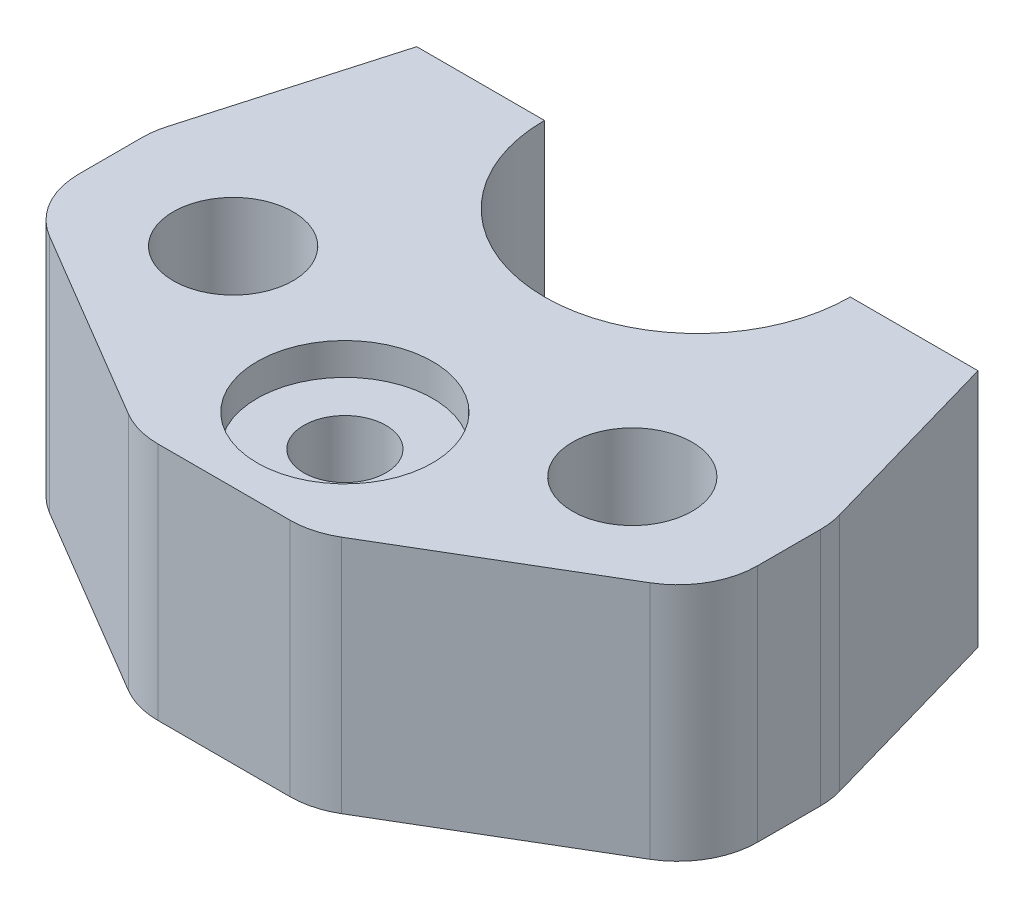
ISO-10303-21;
HEADER;
FILE_DESCRIPTION(('STEP AP214'),'2;1');
FILE_NAME('part.step','',(''),(''),'','','');
FILE_SCHEMA(('AUTOMOTIVE_DESIGN { 1 0 10303 214 1 1 1 1 }'));
ENDSEC;
DATA;
#1=APPLICATION_CONTEXT('core data for automotive mechanical design processes');
#2=APPLICATION_PROTOCOL_DEFINITION('international standard','automotive_design',2000,#1);
#3=PRODUCT_CONTEXT('',#1,'mechanical');
#4=PRODUCT('Part','Part','',(#3));
#5=PRODUCT_RELATED_PRODUCT_CATEGORY('part','',(#4));
#6=PRODUCT_DEFINITION_FORMATION('','',#4);
#7=PRODUCT_DEFINITION_CONTEXT('part definition',#1,'design');
#8=PRODUCT_DEFINITION('design','',#6,#7);
#9=PRODUCT_DEFINITION_SHAPE('','',#8);
#10=(LENGTH_UNIT() NAMED_UNIT(*) SI_UNIT(.MILLI.,.METRE.));
#11=(NAMED_UNIT(*) PLANE_ANGLE_UNIT() SI_UNIT($,.RADIAN.));
#12=(NAMED_UNIT(*) SI_UNIT($,.STERADIAN.) SOLID_ANGLE_UNIT());
#13=UNCERTAINTY_MEASURE_WITH_UNIT(LENGTH_MEASURE(1.E-05),#10,'distance_accuracy_value','');
#14=(GEOMETRIC_REPRESENTATION_CONTEXT(3) GLOBAL_UNCERTAINTY_ASSIGNED_CONTEXT((#13)) GLOBAL_UNIT_ASSIGNED_CONTEXT((#10,
#11,#12)) REPRESENTATION_CONTEXT('',''));
#15=CARTESIAN_POINT('',(0.,0.,0.));
#16=DIRECTION('',(0.,0.,1.));
#17=DIRECTION('',(1.,0.,0.));
#18=AXIS2_PLACEMENT_3D('',#15,#16,#17);
#19=CARTESIAN_POINT('',(0.,30.,44.15));
#20=DIRECTION('',(0.,-1.,0.));
#21=DIRECTION('',(0.,0.,-1.));
#22=AXIS2_PLACEMENT_3D('',#19,#20,#21);
#23=CYLINDRICAL_SURFACE('',#22,5.15);
#24=CARTESIAN_POINT('',(0.,0.,44.15));
#25=DIRECTION('',(0.,1.,0.));
#26=DIRECTION('',(0.,0.,1.));
#27=AXIS2_PLACEMENT_3D('',#24,#25,#26);
#28=CIRCLE('',#27,5.15);
#29=CARTESIAN_POINT('',(0.,0.,49.3));
#30=VERTEX_POINT('',#29);
#31=EDGE_CURVE('E206',#30,#30,#28,.T.);
#32=ORIENTED_EDGE('',*,*,#31,.F.);
#33=EDGE_LOOP('',(#32));
#34=FACE_BOUND('',#33,.T.);
#35=CARTESIAN_POINT('',(0.,26.,44.15));
#36=DIRECTION('',(0.,1.,0.));
#37=DIRECTION('',(0.,0.,1.));
#38=AXIS2_PLACEMENT_3D('',#35,#36,#37);
#39=CIRCLE('',#38,5.15);
#40=CARTESIAN_POINT('',(0.,26.,49.3));
#41=VERTEX_POINT('',#40);
#42=EDGE_CURVE('E43',#41,#41,#39,.T.);
#43=ORIENTED_EDGE('',*,*,#42,.T.);
#44=EDGE_LOOP('',(#43));
#45=FACE_BOUND('',#44,.T.);
#46=ADVANCED_FACE('F39',(#34,#45),#23,.F.);
#47=CARTESIAN_POINT('',(0.,30.,0.));
#48=DIRECTION('',(0.,0.,1.));
#49=DIRECTION('',(1.,0.,0.));
#50=AXIS2_PLACEMENT_3D('',#47,#48,#49);
#51=PLANE('',#50);
#52=DIRECTION('',(-1.,0.,0.));
#53=VECTOR('',#52,1.);
#54=CARTESIAN_POINT('',(0.,0.,0.));
#55=LINE('',#54,#53);
#56=CARTESIAN_POINT('',(35.15,0.,0.));
#57=VERTEX_POINT('',#56);
#58=CARTESIAN_POINT('',(19.15,0.,0.));
#59=VERTEX_POINT('',#58);
#60=EDGE_CURVE('E168',#57,#59,#55,.T.);
#61=ORIENTED_EDGE('',*,*,#60,.T.);
#62=DIRECTION('',(0.,-1.,0.));
#63=VECTOR('',#62,1.);
#64=CARTESIAN_POINT('',(19.15,30.,0.));
#65=LINE('',#64,#63);
#66=CARTESIAN_POINT('',(19.15,30.,0.));
#67=VERTEX_POINT('',#66);
#68=EDGE_CURVE('E165',#67,#59,#65,.T.);
#69=ORIENTED_EDGE('',*,*,#68,.F.);
#70=DIRECTION('',(-1.,0.,0.));
#71=VECTOR('',#70,1.);
#72=CARTESIAN_POINT('',(0.,30.,0.));
#73=LINE('',#72,#71);
#74=CARTESIAN_POINT('',(35.15,30.,0.));
#75=VERTEX_POINT('',#74);
#76=EDGE_CURVE('E153',#75,#67,#73,.T.);
#77=ORIENTED_EDGE('',*,*,#76,.F.);
#78=DIRECTION('',(0.,-1.,0.));
#79=VECTOR('',#78,1.);
#80=CARTESIAN_POINT('',(35.15,30.,0.));
#81=LINE('',#80,#79);
#82=EDGE_CURVE('E205',#75,#57,#81,.T.);
#83=ORIENTED_EDGE('',*,*,#82,.T.);
#84=EDGE_LOOP('',(#61,#69,#77,#83));
#85=FACE_BOUND('',#84,.T.);
#86=ADVANCED_FACE('F166',(#85),#51,.F.);
#87=CARTESIAN_POINT('',(0.,30.,0.));
#88=DIRECTION('',(0.,-1.,0.));
#89=DIRECTION('',(0.,0.,-1.));
#90=AXIS2_PLACEMENT_3D('',#87,#88,#89);
#91=CYLINDRICAL_SURFACE('',#90,19.15);
#92=CARTESIAN_POINT('',(0.,0.,0.));
#93=DIRECTION('',(0.,1.,0.));
#94=DIRECTION('',(0.,0.,1.));
#95=AXIS2_PLACEMENT_3D('',#92,#93,#94);
#96=CIRCLE('',#95,19.15);
#97=CARTESIAN_POINT('',(-19.15,0.,0.));
#98=VERTEX_POINT('',#97);
#99=EDGE_CURVE('E210',#98,#59,#96,.T.);
#100=ORIENTED_EDGE('',*,*,#99,.F.);
#101=DIRECTION('',(0.,-1.,0.));
#102=VECTOR('',#101,1.);
#103=CARTESIAN_POINT('',(-19.15,30.,0.));
#104=LINE('',#103,#102);
#105=CARTESIAN_POINT('',(-19.15,30.,0.));
#106=VERTEX_POINT('',#105);
#107=EDGE_CURVE('E173',#106,#98,#104,.T.);
#108=ORIENTED_EDGE('',*,*,#107,.F.);
#109=CARTESIAN_POINT('',(0.,30.,0.));
#110=DIRECTION('',(0.,1.,0.));
#111=DIRECTION('',(0.,0.,1.));
#112=AXIS2_PLACEMENT_3D('',#109,#110,#111);
#113=CIRCLE('',#112,19.15);
#114=EDGE_CURVE('E159',#106,#67,#113,.T.);
#115=ORIENTED_EDGE('',*,*,#114,.T.);
#116=ORIENTED_EDGE('',*,*,#68,.T.);
#117=EDGE_LOOP('',(#100,#108,#115,#116));
#118=FACE_BOUND('',#117,.T.);
#119=ADVANCED_FACE('F175',(#118),#91,.F.);
#120=CARTESIAN_POINT('',(0.,30.,0.));
#121=DIRECTION('',(0.,0.,1.));
#122=DIRECTION('',(1.,0.,0.));
#123=AXIS2_PLACEMENT_3D('',#120,#121,#122);
#124=PLANE('',#123);
#125=DIRECTION('',(-1.,0.,0.));
#126=VECTOR('',#125,1.);
#127=CARTESIAN_POINT('',(0.,0.,0.));
#128=LINE('',#127,#126);
#129=CARTESIAN_POINT('',(-35.15,0.,0.));
#130=VERTEX_POINT('',#129);
#131=EDGE_CURVE('E212',#98,#130,#128,.T.);
#132=ORIENTED_EDGE('',*,*,#131,.T.);
#133=DIRECTION('',(0.,-1.,0.));
#134=VECTOR('',#133,1.);
#135=CARTESIAN_POINT('',(-35.15,30.,0.));
#136=LINE('',#135,#134);
#137=CARTESIAN_POINT('',(-35.15,30.,0.));
#138=VERTEX_POINT('',#137);
#139=EDGE_CURVE('E241',#138,#130,#136,.T.);
#140=ORIENTED_EDGE('',*,*,#139,.F.);
#141=DIRECTION('',(-1.,0.,0.));
#142=VECTOR('',#141,1.);
#143=CARTESIAN_POINT('',(0.,30.,0.));
#144=LINE('',#143,#142);
#145=EDGE_CURVE('E177',#106,#138,#144,.T.);
#146=ORIENTED_EDGE('',*,*,#145,.F.);
#147=ORIENTED_EDGE('',*,*,#107,.T.);
#148=EDGE_LOOP('',(#132,#140,#146,#147));
#149=FACE_BOUND('',#148,.T.);
#150=ADVANCED_FACE('F330',(#149),#124,.F.);
#151=CARTESIAN_POINT('',(-32.4828124012388,30.,-9.30794039567665));
#152=DIRECTION('',(0.961311521161602,0.,0.275463535303618));
#153=DIRECTION('',(0.275463535303618,0.,-0.961311521161602));
#154=AXIS2_PLACEMENT_3D('',#151,#152,#153);
#155=PLANE('',#154);
#156=DIRECTION('',(-0.275463535303618,0.,0.961311521161602));
#157=VECTOR('',#156,1.);
#158=CARTESIAN_POINT('',(-32.4828124012388,0.,-9.30794039567665));
#159=LINE('',#158,#157);
#160=CARTESIAN_POINT('',(-42.113115211616,0.,24.2998510446192));
#161=VERTEX_POINT('',#160);
#162=EDGE_CURVE('E214',#130,#161,#159,.T.);
#163=ORIENTED_EDGE('',*,*,#162,.T.);
#164=DIRECTION('',(0.,-1.,0.));
#165=VECTOR('',#164,1.);
#166=CARTESIAN_POINT('',(-42.113115211616,30.,24.2998510446192));
#167=LINE('',#166,#165);
#168=CARTESIAN_POINT('',(-42.113115211616,30.,24.2998510446192));
#169=VERTEX_POINT('',#168);
#170=EDGE_CURVE('E261',#161,#169,#167,.F.);
#171=ORIENTED_EDGE('',*,*,#170,.T.);
#172=DIRECTION('',(-0.275463535303618,0.,0.961311521161602));
#173=VECTOR('',#172,1.);
#174=CARTESIAN_POINT('',(-32.4828124012388,30.,-9.30794039567665));
#175=LINE('',#174,#173);
#176=EDGE_CURVE('E179',#138,#169,#175,.T.);
#177=ORIENTED_EDGE('',*,*,#176,.F.);
#178=ORIENTED_EDGE('',*,*,#139,.T.);
#179=EDGE_LOOP('',(#163,#171,#177,#178));
#180=FACE_BOUND('',#179,.T.);
#181=ADVANCED_FACE('F333',(#180),#155,.F.);
#182=CARTESIAN_POINT('',(-42.5,30.,0.));
#183=DIRECTION('',(1.,0.,0.));
#184=DIRECTION('',(0.,0.,-1.));
#185=AXIS2_PLACEMENT_3D('',#182,#183,#184);
#186=PLANE('',#185);
#187=DIRECTION('',(0.,0.,1.));
#188=VECTOR('',#187,1.);
#189=CARTESIAN_POINT('',(-42.5,30.,0.));
#190=LINE('',#189,#188);
#191=CARTESIAN_POINT('',(-42.5,30.,27.0544863976553));
#192=VERTEX_POINT('',#191);
#193=CARTESIAN_POINT('',(-42.5,30.,34.949364858226));
#194=VERTEX_POINT('',#193);
#195=EDGE_CURVE('E184',#192,#194,#190,.T.);
#196=ORIENTED_EDGE('',*,*,#195,.F.);
#197=DIRECTION('',(0.,-1.,0.));
#198=VECTOR('',#197,1.);
#199=CARTESIAN_POINT('',(-42.5,30.,27.0544863976553));
#200=LINE('',#199,#198);
#201=CARTESIAN_POINT('',(-42.5,0.,27.0544863976553));
#202=VERTEX_POINT('',#201);
#203=EDGE_CURVE('E246',#192,#202,#200,.T.);
#204=ORIENTED_EDGE('',*,*,#203,.T.);
#205=DIRECTION('',(0.,0.,1.));
#206=VECTOR('',#205,1.);
#207=CARTESIAN_POINT('',(-42.5,0.,0.));
#208=LINE('',#207,#206);
#209=CARTESIAN_POINT('',(-42.5,0.,34.949364858226));
#210=VERTEX_POINT('',#209);
#211=EDGE_CURVE('E217',#202,#210,#208,.T.);
#212=ORIENTED_EDGE('',*,*,#211,.T.);
#213=DIRECTION('',(0.,-1.,0.));
#214=VECTOR('',#213,1.);
#215=CARTESIAN_POINT('',(-42.5,30.,34.949364858226));
#216=LINE('',#215,#214);
#217=EDGE_CURVE('E172',#210,#194,#216,.F.);
#218=ORIENTED_EDGE('',*,*,#217,.T.);
#219=EDGE_LOOP('',(#196,#204,#212,#218));
#220=FACE_BOUND('',#219,.T.);
#221=ADVANCED_FACE('F341',(#220),#186,.F.);
#222=CARTESIAN_POINT('',(-28.8516591453074,30.,48.7306843473021));
#223=DIRECTION('',(0.50946539309729,0.,-0.86049114651821));
#224=DIRECTION('',(-0.86049114651821,0.,-0.50946539309729));
#225=AXIS2_PLACEMENT_3D('',#222,#223,#224);
#226=PLANE('',#225);
#227=DIRECTION('',(0.86049114651821,0.,0.50946539309729));
#228=VECTOR('',#227,1.);
#229=CARTESIAN_POINT('',(-28.8516591453074,30.,48.7306843473021));
#230=LINE('',#229,#228);
#231=CARTESIAN_POINT('',(-37.5946539309729,30.,43.5542763234081));
#232=VERTEX_POINT('',#231);
#233=CARTESIAN_POINT('',(-13.3563157558586,30.,57.9049114651821));
#234=VERTEX_POINT('',#233);
#235=EDGE_CURVE('E187',#232,#234,#230,.T.);
#236=ORIENTED_EDGE('',*,*,#235,.F.);
#237=DIRECTION('',(0.,-1.,0.));
#238=VECTOR('',#237,1.);
#239=CARTESIAN_POINT('',(-37.5946539309729,30.,43.5542763234081));
#240=LINE('',#239,#238);
#241=CARTESIAN_POINT('',(-37.5946539309729,0.,43.5542763234081));
#242=VERTEX_POINT('',#241);
#243=EDGE_CURVE('E275',#232,#242,#240,.T.);
#244=ORIENTED_EDGE('',*,*,#243,.T.);
#245=DIRECTION('',(0.86049114651821,0.,0.50946539309729));
#246=VECTOR('',#245,1.);
#247=CARTESIAN_POINT('',(-28.8516591453074,0.,48.7306843473021));
#248=LINE('',#247,#246);
#249=CARTESIAN_POINT('',(-13.3563157558586,0.,57.9049114651821));
#250=VERTEX_POINT('',#249);
#251=EDGE_CURVE('E220',#242,#250,#248,.T.);
#252=ORIENTED_EDGE('',*,*,#251,.T.);
#253=DIRECTION('',(0.,-1.,0.));
#254=VECTOR('',#253,1.);
#255=CARTESIAN_POINT('',(-13.3563157558586,30.,57.9049114651821));
#256=LINE('',#255,#254);
#257=EDGE_CURVE('E273',#250,#234,#256,.F.);
#258=ORIENTED_EDGE('',*,*,#257,.T.);
#259=EDGE_LOOP('',(#236,#244,#252,#258));
#260=FACE_BOUND('',#259,.T.);
#261=ADVANCED_FACE('F349',(#260),#226,.F.);
#262=CARTESIAN_POINT('',(0.,30.,59.3));
#263=DIRECTION('',(0.,0.,-1.));
#264=DIRECTION('',(-1.,0.,0.));
#265=AXIS2_PLACEMENT_3D('',#262,#263,#264);
#266=PLANE('',#265);
#267=DIRECTION('',(1.,0.,0.));
#268=VECTOR('',#267,1.);
#269=CARTESIAN_POINT('',(0.,0.,59.3));
#270=LINE('',#269,#268);
#271=CARTESIAN_POINT('',(-8.26166182488574,0.,59.3));
#272=VERTEX_POINT('',#271);
#273=CARTESIAN_POINT('',(8.26166182488575,0.,59.3));
#274=VERTEX_POINT('',#273);
#275=EDGE_CURVE('E223',#272,#274,#270,.T.);
#276=ORIENTED_EDGE('',*,*,#275,.T.);
#277=DIRECTION('',(0.,-1.,0.));
#278=VECTOR('',#277,1.);
#279=CARTESIAN_POINT('',(8.26166182488575,30.,59.3));
#280=LINE('',#279,#278);
#281=CARTESIAN_POINT('',(8.26166182488575,30.,59.3));
#282=VERTEX_POINT('',#281);
#283=EDGE_CURVE('E11',#274,#282,#280,.F.);
#284=ORIENTED_EDGE('',*,*,#283,.T.);
#285=DIRECTION('',(1.,0.,0.));
#286=VECTOR('',#285,1.);
#287=CARTESIAN_POINT('',(0.,30.,59.3));
#288=LINE('',#287,#286);
#289=CARTESIAN_POINT('',(-8.26166182488574,30.,59.3));
#290=VERTEX_POINT('',#289);
#291=EDGE_CURVE('E190',#290,#282,#288,.T.);
#292=ORIENTED_EDGE('',*,*,#291,.F.);
#293=DIRECTION('',(0.,-1.,0.));
#294=VECTOR('',#293,1.);
#295=CARTESIAN_POINT('',(-8.26166182488574,30.,59.3));
#296=LINE('',#295,#294);
#297=EDGE_CURVE('E48',#290,#272,#296,.T.);
#298=ORIENTED_EDGE('',*,*,#297,.T.);
#299=EDGE_LOOP('',(#276,#284,#292,#298));
#300=FACE_BOUND('',#299,.T.);
#301=ADVANCED_FACE('F296',(#300),#266,.F.);
#302=CARTESIAN_POINT('',(28.8516591453075,30.,48.7306843473021));
#303=DIRECTION('',(0.50946539309729,0.,0.86049114651821));
#304=DIRECTION('',(0.86049114651821,0.,-0.50946539309729));
#305=AXIS2_PLACEMENT_3D('',#302,#303,#304);
#306=PLANE('',#305);
#307=DIRECTION('',(-0.86049114651821,0.,0.50946539309729));
#308=VECTOR('',#307,1.);
#309=CARTESIAN_POINT('',(28.8516591453075,0.,48.7306843473021));
#310=LINE('',#309,#308);
#311=CARTESIAN_POINT('',(37.5946539309729,0.,43.5542763234081));
#312=VERTEX_POINT('',#311);
#313=CARTESIAN_POINT('',(13.3563157558586,0.,57.9049114651821));
#314=VERTEX_POINT('',#313);
#315=EDGE_CURVE('E226',#312,#314,#310,.T.);
#316=ORIENTED_EDGE('',*,*,#315,.F.);
#317=DIRECTION('',(0.,-1.,0.));
#318=VECTOR('',#317,1.);
#319=CARTESIAN_POINT('',(37.5946539309729,30.,43.5542763234081));
#320=LINE('',#319,#318);
#321=CARTESIAN_POINT('',(37.5946539309729,30.,43.5542763234081));
#322=VERTEX_POINT('',#321);
#323=EDGE_CURVE('E289',#312,#322,#320,.F.);
#324=ORIENTED_EDGE('',*,*,#323,.T.);
#325=DIRECTION('',(-0.86049114651821,0.,0.50946539309729));
#326=VECTOR('',#325,1.);
#327=CARTESIAN_POINT('',(28.8516591453075,30.,48.7306843473021));
#328=LINE('',#327,#326);
#329=CARTESIAN_POINT('',(13.3563157558586,30.,57.9049114651821));
#330=VERTEX_POINT('',#329);
#331=EDGE_CURVE('E193',#322,#330,#328,.T.);
#332=ORIENTED_EDGE('',*,*,#331,.T.);
#333=DIRECTION('',(0.,-1.,0.));
#334=VECTOR('',#333,1.);
#335=CARTESIAN_POINT('',(13.3563157558587,0.,57.9049114651821));
#336=LINE('',#335,#334);
#337=EDGE_CURVE('E286',#330,#314,#336,.T.);
#338=ORIENTED_EDGE('',*,*,#337,.T.);
#339=EDGE_LOOP('',(#316,#324,#332,#338));
#340=FACE_BOUND('',#339,.T.);
#341=ADVANCED_FACE('F311',(#340),#306,.T.);
#342=CARTESIAN_POINT('',(42.5,30.,0.));
#343=DIRECTION('',(1.,0.,0.));
#344=DIRECTION('',(0.,0.,-1.));
#345=AXIS2_PLACEMENT_3D('',#342,#343,#344);
#346=PLANE('',#345);
#347=DIRECTION('',(0.,0.,1.));
#348=VECTOR('',#347,1.);
#349=CARTESIAN_POINT('',(42.5,0.,0.));
#350=LINE('',#349,#348);
#351=CARTESIAN_POINT('',(42.5,0.,27.0544863976553));
#352=VERTEX_POINT('',#351);
#353=CARTESIAN_POINT('',(42.5,0.,34.949364858226));
#354=VERTEX_POINT('',#353);
#355=EDGE_CURVE('E229',#352,#354,#350,.T.);
#356=ORIENTED_EDGE('',*,*,#355,.F.);
#357=DIRECTION('',(0.,-1.,0.));
#358=VECTOR('',#357,1.);
#359=CARTESIAN_POINT('',(42.5,30.,27.0544863976553));
#360=LINE('',#359,#358);
#361=CARTESIAN_POINT('',(42.5,30.,27.0544863976553));
#362=VERTEX_POINT('',#361);
#363=EDGE_CURVE('E284',#352,#362,#360,.F.);
#364=ORIENTED_EDGE('',*,*,#363,.T.);
#365=DIRECTION('',(0.,0.,1.));
#366=VECTOR('',#365,1.);
#367=CARTESIAN_POINT('',(42.5,30.,0.));
#368=LINE('',#367,#366);
#369=CARTESIAN_POINT('',(42.5,30.,34.949364858226));
#370=VERTEX_POINT('',#369);
#371=EDGE_CURVE('E196',#362,#370,#368,.T.);
#372=ORIENTED_EDGE('',*,*,#371,.T.);
#373=DIRECTION('',(0.,-1.,0.));
#374=VECTOR('',#373,1.);
#375=CARTESIAN_POINT('',(42.5,30.,34.949364858226));
#376=LINE('',#375,#374);
#377=EDGE_CURVE('E281',#370,#354,#376,.T.);
#378=ORIENTED_EDGE('',*,*,#377,.T.);
#379=EDGE_LOOP('',(#356,#364,#372,#378));
#380=FACE_BOUND('',#379,.T.);
#381=ADVANCED_FACE('F318',(#380),#346,.T.);
#382=CARTESIAN_POINT('',(-25.,30.,33.15));
#383=DIRECTION('',(0.,-1.,0.));
#384=DIRECTION('',(0.,0.,-1.));
#385=AXIS2_PLACEMENT_3D('',#382,#383,#384);
#386=CYLINDRICAL_SURFACE('',#385,7.5);
#387=CARTESIAN_POINT('',(-25.,30.,33.15));
#388=DIRECTION('',(0.,1.,0.));
#389=DIRECTION('',(0.,0.,1.));
#390=AXIS2_PLACEMENT_3D('',#387,#388,#389);
#391=CIRCLE('',#390,7.5);
#392=CARTESIAN_POINT('',(-25.,30.,40.65));
#393=VERTEX_POINT('',#392);
#394=EDGE_CURVE('E199',#393,#393,#391,.T.);
#395=ORIENTED_EDGE('',*,*,#394,.T.);
#396=EDGE_LOOP('',(#395));
#397=FACE_BOUND('',#396,.T.);
#398=CARTESIAN_POINT('',(-25.,0.,33.15));
#399=DIRECTION('',(0.,1.,0.));
#400=DIRECTION('',(0.,0.,1.));
#401=AXIS2_PLACEMENT_3D('',#398,#399,#400);
#402=CIRCLE('',#401,7.5);
#403=CARTESIAN_POINT('',(-25.,0.,40.65));
#404=VERTEX_POINT('',#403);
#405=EDGE_CURVE('E235',#404,#404,#402,.T.);
#406=ORIENTED_EDGE('',*,*,#405,.F.);
#407=EDGE_LOOP('',(#406));
#408=FACE_BOUND('',#407,.T.);
#409=ADVANCED_FACE('F434',(#397,#408),#386,.F.);
#410=CARTESIAN_POINT('',(32.4828124012388,30.,-9.30794039567665));
#411=DIRECTION('',(0.961311521161602,0.,-0.275463535303618));
#412=DIRECTION('',(-0.275463535303618,0.,-0.961311521161602));
#413=AXIS2_PLACEMENT_3D('',#410,#411,#412);
#414=PLANE('',#413);
#415=DIRECTION('',(0.275463535303618,0.,0.961311521161602));
#416=VECTOR('',#415,1.);
#417=CARTESIAN_POINT('',(32.4828124012388,30.,-9.30794039567665));
#418=LINE('',#417,#416);
#419=CARTESIAN_POINT('',(42.113115211616,30.,24.2998510446192));
#420=VERTEX_POINT('',#419);
#421=EDGE_CURVE('E160',#75,#420,#418,.T.);
#422=ORIENTED_EDGE('',*,*,#421,.T.);
#423=DIRECTION('',(0.,-1.,0.));
#424=VECTOR('',#423,1.);
#425=CARTESIAN_POINT('',(42.113115211616,30.,24.2998510446192));
#426=LINE('',#425,#424);
#427=CARTESIAN_POINT('',(42.113115211616,0.,24.2998510446192));
#428=VERTEX_POINT('',#427);
#429=EDGE_CURVE('E278',#420,#428,#426,.T.);
#430=ORIENTED_EDGE('',*,*,#429,.T.);
#431=DIRECTION('',(0.275463535303618,0.,0.961311521161602));
#432=VECTOR('',#431,1.);
#433=CARTESIAN_POINT('',(32.4828124012388,0.,-9.30794039567665));
#434=LINE('',#433,#432);
#435=EDGE_CURVE('E232',#57,#428,#434,.T.);
#436=ORIENTED_EDGE('',*,*,#435,.F.);
#437=ORIENTED_EDGE('',*,*,#82,.F.);
#438=EDGE_LOOP('',(#422,#430,#436,#437));
#439=FACE_BOUND('',#438,.T.);
#440=ADVANCED_FACE('F325',(#439),#414,.T.);
#441=CARTESIAN_POINT('',(25.,30.,33.15));
#442=DIRECTION('',(0.,-1.,0.));
#443=DIRECTION('',(0.,0.,-1.));
#444=AXIS2_PLACEMENT_3D('',#441,#442,#443);
#445=CYLINDRICAL_SURFACE('',#444,7.5);
#446=CARTESIAN_POINT('',(25.,30.,33.15));
#447=DIRECTION('',(0.,1.,0.));
#448=DIRECTION('',(0.,0.,1.));
#449=AXIS2_PLACEMENT_3D('',#446,#447,#448);
#450=CIRCLE('',#449,7.5);
#451=CARTESIAN_POINT('',(25.,30.,40.65));
#452=VERTEX_POINT('',#451);
#453=EDGE_CURVE('E202',#452,#452,#450,.F.);
#454=ORIENTED_EDGE('',*,*,#453,.F.);
#455=EDGE_LOOP('',(#454));
#456=FACE_BOUND('',#455,.T.);
#457=CARTESIAN_POINT('',(25.,0.,33.15));
#458=DIRECTION('',(0.,1.,0.));
#459=DIRECTION('',(0.,0.,1.));
#460=AXIS2_PLACEMENT_3D('',#457,#458,#459);
#461=CIRCLE('',#460,7.5);
#462=CARTESIAN_POINT('',(25.,0.,40.65));
#463=VERTEX_POINT('',#462);
#464=EDGE_CURVE('E162',#463,#463,#461,.F.);
#465=ORIENTED_EDGE('',*,*,#464,.T.);
#466=EDGE_LOOP('',(#465));
#467=FACE_BOUND('',#466,.T.);
#468=ADVANCED_FACE('F404',(#456,#467),#445,.F.);
#469=CARTESIAN_POINT('',(0.,30.,0.));
#470=DIRECTION('',(0.,1.,0.));
#471=DIRECTION('',(0.,0.,1.));
#472=AXIS2_PLACEMENT_3D('',#469,#470,#471);
#473=PLANE('',#472);
#474=CARTESIAN_POINT('',(0.,30.,44.15));
#475=DIRECTION('',(0.,1.,0.));
#476=DIRECTION('',(0.,0.,1.));
#477=AXIS2_PLACEMENT_3D('',#474,#475,#476);
#478=CIRCLE('',#477,11.);
#479=CARTESIAN_POINT('',(0.,30.,55.15));
#480=VERTEX_POINT('',#479);
#481=EDGE_CURVE('E578',#480,#480,#478,.T.);
#482=ORIENTED_EDGE('',*,*,#481,.F.);
#483=EDGE_LOOP('',(#482));
#484=FACE_BOUND('',#483,.T.);
#485=ORIENTED_EDGE('',*,*,#176,.T.);
#486=CARTESIAN_POINT('',(-32.5,30.,27.0544863976553));
#487=DIRECTION('',(0.,1.,0.));
#488=DIRECTION('',(0.,0.,1.));
#489=AXIS2_PLACEMENT_3D('',#486,#487,#488);
#490=CIRCLE('',#489,10.);
#491=EDGE_CURVE('E271',#169,#192,#490,.T.);
#492=ORIENTED_EDGE('',*,*,#491,.T.);
#493=ORIENTED_EDGE('',*,*,#195,.T.);
#494=CARTESIAN_POINT('',(-32.5,30.,34.949364858226));
#495=DIRECTION('',(0.,1.,0.));
#496=DIRECTION('',(0.,0.,1.));
#497=AXIS2_PLACEMENT_3D('',#494,#495,#496);
#498=CIRCLE('',#497,10.);
#499=EDGE_CURVE('E269',#194,#232,#498,.T.);
#500=ORIENTED_EDGE('',*,*,#499,.T.);
#501=ORIENTED_EDGE('',*,*,#235,.T.);
#502=CARTESIAN_POINT('',(-8.26166182488574,30.,49.3));
#503=DIRECTION('',(0.,1.,0.));
#504=DIRECTION('',(0.,0.,1.));
#505=AXIS2_PLACEMENT_3D('',#502,#503,#504);
#506=CIRCLE('',#505,10.);
#507=EDGE_CURVE('E263',#234,#290,#506,.T.);
#508=ORIENTED_EDGE('',*,*,#507,.T.);
#509=ORIENTED_EDGE('',*,*,#291,.T.);
#510=CARTESIAN_POINT('',(8.26166182488575,30.,49.3));
#511=DIRECTION('',(0.,1.,0.));
#512=DIRECTION('',(0.,0.,1.));
#513=AXIS2_PLACEMENT_3D('',#510,#511,#512);
#514=CIRCLE('',#513,10.);
#515=EDGE_CURVE('E265',#282,#330,#514,.T.);
#516=ORIENTED_EDGE('',*,*,#515,.T.);
#517=ORIENTED_EDGE('',*,*,#331,.F.);
#518=CARTESIAN_POINT('',(32.5,30.,34.949364858226));
#519=DIRECTION('',(0.,1.,0.));
#520=DIRECTION('',(0.,0.,1.));
#521=AXIS2_PLACEMENT_3D('',#518,#519,#520);
#522=CIRCLE('',#521,10.);
#523=EDGE_CURVE('E61',#322,#370,#522,.T.);
#524=ORIENTED_EDGE('',*,*,#523,.T.);
#525=ORIENTED_EDGE('',*,*,#371,.F.);
#526=CARTESIAN_POINT('',(32.5,30.,27.0544863976553));
#527=DIRECTION('',(0.,1.,0.));
#528=DIRECTION('',(0.,0.,1.));
#529=AXIS2_PLACEMENT_3D('',#526,#527,#528);
#530=CIRCLE('',#529,10.);
#531=EDGE_CURVE('E55',#362,#420,#530,.T.);
#532=ORIENTED_EDGE('',*,*,#531,.T.);
#533=ORIENTED_EDGE('',*,*,#421,.F.);
#534=ORIENTED_EDGE('',*,*,#76,.T.);
#535=ORIENTED_EDGE('',*,*,#114,.F.);
#536=ORIENTED_EDGE('',*,*,#145,.T.);
#537=EDGE_LOOP('',(#485,#492,#493,#500,#501,#508,#509,#516,#517,#524,#525,#532,#533,#534,#535,#536));
#538=FACE_BOUND('',#537,.T.);
#539=ORIENTED_EDGE('',*,*,#394,.F.);
#540=EDGE_LOOP('',(#539));
#541=FACE_BOUND('',#540,.T.);
#542=ORIENTED_EDGE('',*,*,#453,.T.);
#543=EDGE_LOOP('',(#542));
#544=FACE_BOUND('',#543,.T.);
#545=ADVANCED_FACE('F156',(#484,#538,#541,#544),#473,.T.);
#546=CARTESIAN_POINT('',(0.,0.,0.));
#547=DIRECTION('',(0.,1.,0.));
#548=DIRECTION('',(0.,0.,1.));
#549=AXIS2_PLACEMENT_3D('',#546,#547,#548);
#550=PLANE('',#549);
#551=ORIENTED_EDGE('',*,*,#31,.T.);
#552=EDGE_LOOP('',(#551));
#553=FACE_BOUND('',#552,.T.);
#554=ORIENTED_EDGE('',*,*,#211,.F.);
#555=CARTESIAN_POINT('',(-32.5,0.,27.0544863976553));
#556=DIRECTION('',(0.,1.,0.));
#557=DIRECTION('',(0.,0.,1.));
#558=AXIS2_PLACEMENT_3D('',#555,#556,#557);
#559=CIRCLE('',#558,10.);
#560=EDGE_CURVE('E259',#202,#161,#559,.F.);
#561=ORIENTED_EDGE('',*,*,#560,.T.);
#562=ORIENTED_EDGE('',*,*,#162,.F.);
#563=ORIENTED_EDGE('',*,*,#131,.F.);
#564=ORIENTED_EDGE('',*,*,#99,.T.);
#565=ORIENTED_EDGE('',*,*,#60,.F.);
#566=ORIENTED_EDGE('',*,*,#435,.T.);
#567=CARTESIAN_POINT('',(32.5,0.,27.0544863976553));
#568=DIRECTION('',(0.,1.,0.));
#569=DIRECTION('',(0.,0.,1.));
#570=AXIS2_PLACEMENT_3D('',#567,#568,#569);
#571=CIRCLE('',#570,10.);
#572=EDGE_CURVE('E255',#428,#352,#571,.F.);
#573=ORIENTED_EDGE('',*,*,#572,.T.);
#574=ORIENTED_EDGE('',*,*,#355,.T.);
#575=CARTESIAN_POINT('',(32.5,0.,34.949364858226));
#576=DIRECTION('',(0.,1.,0.));
#577=DIRECTION('',(0.,0.,1.));
#578=AXIS2_PLACEMENT_3D('',#575,#576,#577);
#579=CIRCLE('',#578,10.);
#580=EDGE_CURVE('E253',#354,#312,#579,.F.);
#581=ORIENTED_EDGE('',*,*,#580,.T.);
#582=ORIENTED_EDGE('',*,*,#315,.T.);
#583=CARTESIAN_POINT('',(8.26166182488575,0.,49.3));
#584=DIRECTION('',(0.,1.,0.));
#585=DIRECTION('',(0.,0.,1.));
#586=AXIS2_PLACEMENT_3D('',#583,#584,#585);
#587=CIRCLE('',#586,10.);
#588=EDGE_CURVE('E251',#314,#274,#587,.F.);
#589=ORIENTED_EDGE('',*,*,#588,.T.);
#590=ORIENTED_EDGE('',*,*,#275,.F.);
#591=CARTESIAN_POINT('',(-8.26166182488574,0.,49.3));
#592=DIRECTION('',(0.,1.,0.));
#593=DIRECTION('',(0.,0.,1.));
#594=AXIS2_PLACEMENT_3D('',#591,#592,#593);
#595=CIRCLE('',#594,10.);
#596=EDGE_CURVE('E249',#272,#250,#595,.F.);
#597=ORIENTED_EDGE('',*,*,#596,.T.);
#598=ORIENTED_EDGE('',*,*,#251,.F.);
#599=CARTESIAN_POINT('',(-32.5,0.,34.949364858226));
#600=DIRECTION('',(0.,1.,0.));
#601=DIRECTION('',(0.,0.,1.));
#602=AXIS2_PLACEMENT_3D('',#599,#600,#601);
#603=CIRCLE('',#602,10.);
#604=EDGE_CURVE('E257',#242,#210,#603,.F.);
#605=ORIENTED_EDGE('',*,*,#604,.T.);
#606=EDGE_LOOP('',(#554,#561,#562,#563,#564,#565,#566,#573,#574,#581,#582,#589,#590,#597,#598,#605));
#607=FACE_BOUND('',#606,.T.);
#608=ORIENTED_EDGE('',*,*,#405,.T.);
#609=EDGE_LOOP('',(#608));
#610=FACE_BOUND('',#609,.T.);
#611=ORIENTED_EDGE('',*,*,#464,.F.);
#612=EDGE_LOOP('',(#611));
#613=FACE_BOUND('',#612,.T.);
#614=ADVANCED_FACE('F302',(#553,#607,#610,#613),#550,.F.);
#615=CARTESIAN_POINT('',(-32.5,30.,27.0544863976553));
#616=DIRECTION('',(0.,-1.,0.));
#617=DIRECTION('',(0.,0.,-1.));
#618=AXIS2_PLACEMENT_3D('',#615,#616,#617);
#619=CYLINDRICAL_SURFACE('',#618,10.);
#620=ORIENTED_EDGE('',*,*,#491,.F.);
#621=ORIENTED_EDGE('',*,*,#170,.F.);
#622=ORIENTED_EDGE('',*,*,#560,.F.);
#623=ORIENTED_EDGE('',*,*,#203,.F.);
#624=EDGE_LOOP('',(#620,#621,#622,#623));
#625=FACE_BOUND('',#624,.T.);
#626=ADVANCED_FACE('F339',(#625),#619,.T.);
#627=CARTESIAN_POINT('',(-32.5,30.,34.949364858226));
#628=DIRECTION('',(0.,-1.,0.));
#629=DIRECTION('',(0.,0.,-1.));
#630=AXIS2_PLACEMENT_3D('',#627,#628,#629);
#631=CYLINDRICAL_SURFACE('',#630,10.);
#632=ORIENTED_EDGE('',*,*,#499,.F.);
#633=ORIENTED_EDGE('',*,*,#217,.F.);
#634=ORIENTED_EDGE('',*,*,#604,.F.);
#635=ORIENTED_EDGE('',*,*,#243,.F.);
#636=EDGE_LOOP('',(#632,#633,#634,#635));
#637=FACE_BOUND('',#636,.T.);
#638=ADVANCED_FACE('F346',(#637),#631,.T.);
#639=CARTESIAN_POINT('',(32.5,30.,27.0544863976553));
#640=DIRECTION('',(0.,-1.,0.));
#641=DIRECTION('',(0.,0.,-1.));
#642=AXIS2_PLACEMENT_3D('',#639,#640,#641);
#643=CYLINDRICAL_SURFACE('',#642,10.);
#644=ORIENTED_EDGE('',*,*,#531,.F.);
#645=ORIENTED_EDGE('',*,*,#363,.F.);
#646=ORIENTED_EDGE('',*,*,#572,.F.);
#647=ORIENTED_EDGE('',*,*,#429,.F.);
#648=EDGE_LOOP('',(#644,#645,#646,#647));
#649=FACE_BOUND('',#648,.T.);
#650=ADVANCED_FACE('F323',(#649),#643,.T.);
#651=CARTESIAN_POINT('',(32.5,30.,34.949364858226));
#652=DIRECTION('',(0.,-1.,0.));
#653=DIRECTION('',(0.,0.,-1.));
#654=AXIS2_PLACEMENT_3D('',#651,#652,#653);
#655=CYLINDRICAL_SURFACE('',#654,10.);
#656=ORIENTED_EDGE('',*,*,#523,.F.);
#657=ORIENTED_EDGE('',*,*,#323,.F.);
#658=ORIENTED_EDGE('',*,*,#580,.F.);
#659=ORIENTED_EDGE('',*,*,#377,.F.);
#660=EDGE_LOOP('',(#656,#657,#658,#659));
#661=FACE_BOUND('',#660,.T.);
#662=ADVANCED_FACE('F315',(#661),#655,.T.);
#663=CARTESIAN_POINT('',(8.26166182488575,30.,49.3));
#664=DIRECTION('',(0.,1.,0.));
#665=DIRECTION('',(0.,0.,1.));
#666=AXIS2_PLACEMENT_3D('',#663,#664,#665);
#667=CYLINDRICAL_SURFACE('',#666,10.);
#668=ORIENTED_EDGE('',*,*,#515,.F.);
#669=ORIENTED_EDGE('',*,*,#283,.F.);
#670=ORIENTED_EDGE('',*,*,#588,.F.);
#671=ORIENTED_EDGE('',*,*,#337,.F.);
#672=EDGE_LOOP('',(#668,#669,#670,#671));
#673=FACE_BOUND('',#672,.T.);
#674=ADVANCED_FACE('F309',(#673),#667,.T.);
#675=CARTESIAN_POINT('',(-8.26166182488574,30.,49.3));
#676=DIRECTION('',(0.,-1.,0.));
#677=DIRECTION('',(0.,0.,-1.));
#678=AXIS2_PLACEMENT_3D('',#675,#676,#677);
#679=CYLINDRICAL_SURFACE('',#678,10.);
#680=ORIENTED_EDGE('',*,*,#507,.F.);
#681=ORIENTED_EDGE('',*,*,#257,.F.);
#682=ORIENTED_EDGE('',*,*,#596,.F.);
#683=ORIENTED_EDGE('',*,*,#297,.F.);
#684=EDGE_LOOP('',(#680,#681,#682,#683));
#685=FACE_BOUND('',#684,.T.);
#686=ADVANCED_FACE('F41',(#685),#679,.T.);
#687=CARTESIAN_POINT('',(0.,26.,44.15));
#688=DIRECTION('',(0.,1.,0.));
#689=DIRECTION('',(0.,0.,1.));
#690=AXIS2_PLACEMENT_3D('',#687,#688,#689);
#691=CYLINDRICAL_SURFACE('',#690,11.);
#692=CARTESIAN_POINT('',(0.,26.,44.15));
#693=DIRECTION('',(0.,1.,0.));
#694=DIRECTION('',(0.,0.,1.));
#695=AXIS2_PLACEMENT_3D('',#692,#693,#694);
#696=CIRCLE('',#695,11.);
#697=CARTESIAN_POINT('',(0.,26.,55.15));
#698=VERTEX_POINT('',#697);
#699=EDGE_CURVE('E577',#698,#698,#696,.T.);
#700=ORIENTED_EDGE('',*,*,#699,.F.);
#701=EDGE_LOOP('',(#700));
#702=FACE_BOUND('',#701,.T.);
#703=ORIENTED_EDGE('',*,*,#481,.T.);
#704=EDGE_LOOP('',(#703));
#705=FACE_BOUND('',#704,.T.);
#706=ADVANCED_FACE('F352',(#702,#705),#691,.F.);
#707=CARTESIAN_POINT('',(0.,26.,44.15));
#708=DIRECTION('',(0.,1.,0.));
#709=DIRECTION('',(0.,0.,1.));
#710=AXIS2_PLACEMENT_3D('',#707,#708,#709);
#711=PLANE('',#710);
#712=ORIENTED_EDGE('',*,*,#42,.F.);
#713=EDGE_LOOP('',(#712));
#714=FACE_BOUND('',#713,.T.);
#715=ORIENTED_EDGE('',*,*,#699,.T.);
#716=EDGE_LOOP('',(#715));
#717=FACE_BOUND('',#716,.T.);
#718=ADVANCED_FACE('F357',(#714,#717),#711,.T.);
#719=CLOSED_SHELL('',(#46,#86,#119,#150,#181,#221,#261,#301,#341,#381,#409,#440,#468,#545,#614,
#626,#638,#650,#662,#674,#686,#706,#718));
#720=MANIFOLD_SOLID_BREP('B2',#719);
#721=ADVANCED_BREP_SHAPE_REPRESENTATION('',(#18,#720),#14);
#722=SHAPE_DEFINITION_REPRESENTATION(#9,#721);
ENDSEC;
END-ISO-10303-21;
